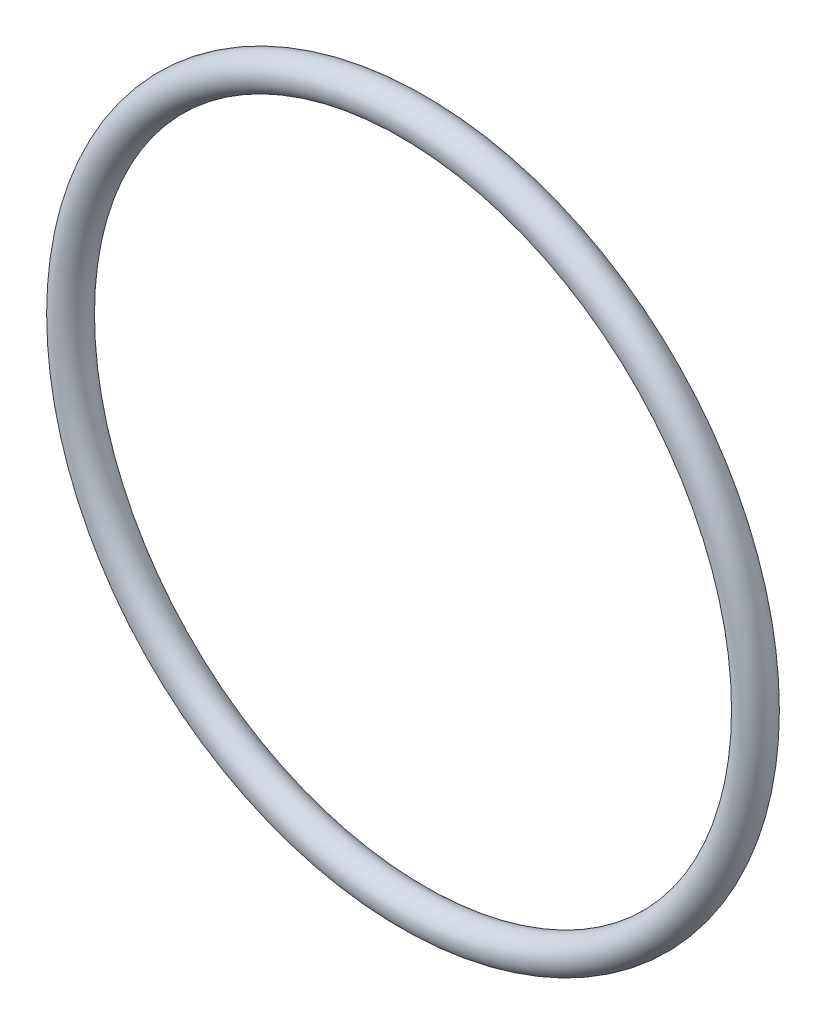
ISO-10303-21;
HEADER;
FILE_DESCRIPTION(('STEP AP214'),'2;1');
FILE_NAME('part.step','',(''),(''),'','','');
FILE_SCHEMA(('AUTOMOTIVE_DESIGN { 1 0 10303 214 1 1 1 1 }'));
ENDSEC;
DATA;
#1=APPLICATION_CONTEXT('core data for automotive mechanical design processes');
#2=APPLICATION_PROTOCOL_DEFINITION('international standard','automotive_design',2000,#1);
#3=PRODUCT_CONTEXT('',#1,'mechanical');
#4=PRODUCT('Part','Part','',(#3));
#5=PRODUCT_RELATED_PRODUCT_CATEGORY('part','',(#4));
#6=PRODUCT_DEFINITION_FORMATION('','',#4);
#7=PRODUCT_DEFINITION_CONTEXT('part definition',#1,'design');
#8=PRODUCT_DEFINITION('design','',#6,#7);
#9=PRODUCT_DEFINITION_SHAPE('','',#8);
#10=(LENGTH_UNIT() NAMED_UNIT(*) SI_UNIT(.MILLI.,.METRE.));
#11=(NAMED_UNIT(*) PLANE_ANGLE_UNIT() SI_UNIT($,.RADIAN.));
#12=(NAMED_UNIT(*) SI_UNIT($,.STERADIAN.) SOLID_ANGLE_UNIT());
#13=UNCERTAINTY_MEASURE_WITH_UNIT(LENGTH_MEASURE(1.E-05),#10,'distance_accuracy_value','');
#14=(GEOMETRIC_REPRESENTATION_CONTEXT(3) GLOBAL_UNCERTAINTY_ASSIGNED_CONTEXT((#13)) GLOBAL_UNIT_ASSIGNED_CONTEXT((#10,
#11,#12)) REPRESENTATION_CONTEXT('',''));
#15=CARTESIAN_POINT('',(0.,0.,0.));
#16=DIRECTION('',(0.,0.,1.));
#17=DIRECTION('',(1.,0.,0.));
#18=AXIS2_PLACEMENT_3D('',#15,#16,#17);
#19=CARTESIAN_POINT('',(0.,0.,0.));
#20=DIRECTION('',(0.,0.,-1.));
#21=DIRECTION('',(-1.,0.,0.));
#22=AXIS2_PLACEMENT_3D('',#19,#20,#21);
#23=TOROIDAL_SURFACE('',#22,57.65,2.85);
#24=CARTESIAN_POINT('',(-60.5,0.,0.));
#25=VERTEX_POINT('',#24);
#26=VERTEX_LOOP('',#25);
#27=FACE_BOUND('',#26,.T.);
#28=ADVANCED_FACE('F29',(#27),#23,.T.);
#29=CLOSED_SHELL('',(#28));
#30=MANIFOLD_SOLID_BREP('B2',#29);
#31=ADVANCED_BREP_SHAPE_REPRESENTATION('',(#18,#30),#14);
#32=SHAPE_DEFINITION_REPRESENTATION(#9,#31);
ENDSEC;
END-ISO-10303-21;
